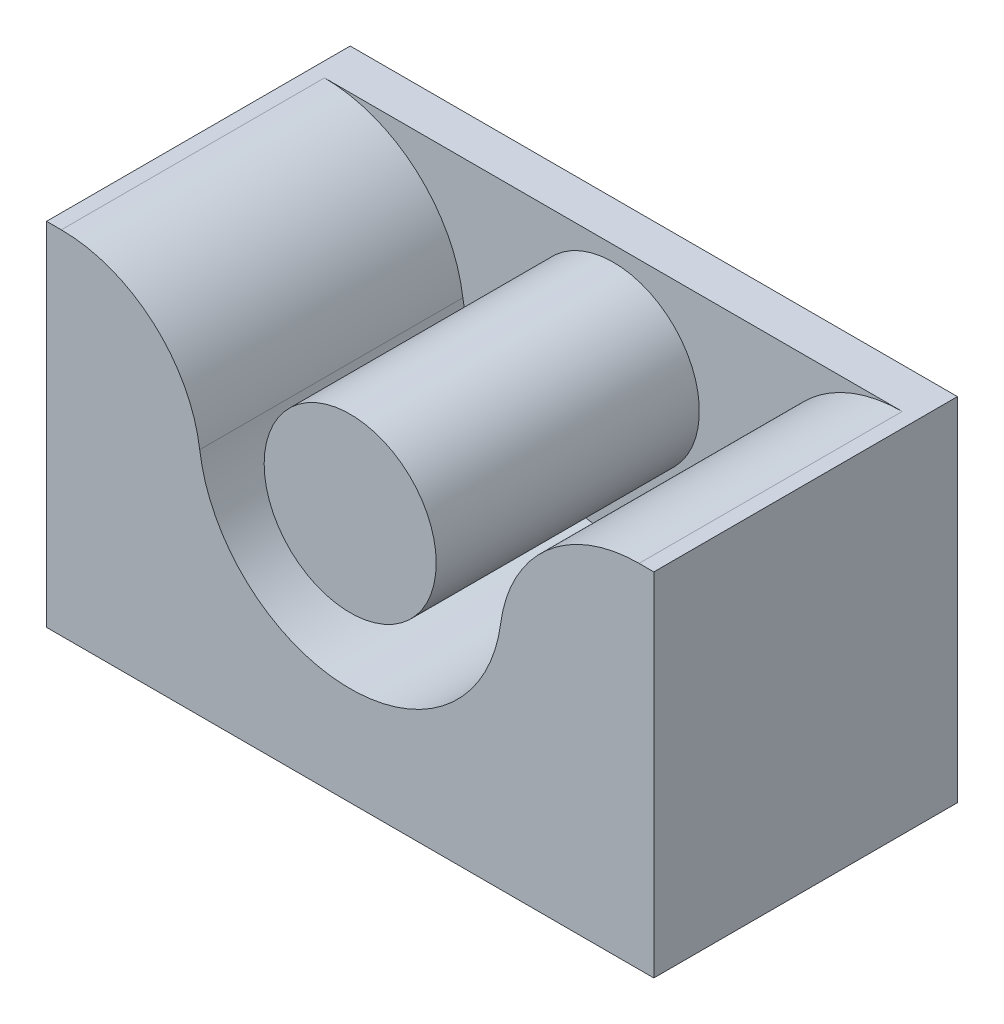
ISO-10303-21;
HEADER;
FILE_DESCRIPTION(('STEP AP214'),'2;1');
FILE_NAME('part.step','',(''),(''),'','','');
FILE_SCHEMA(('AUTOMOTIVE_DESIGN { 1 0 10303 214 1 1 1 1 }'));
ENDSEC;
DATA;
#1=APPLICATION_CONTEXT('core data for automotive mechanical design processes');
#2=APPLICATION_PROTOCOL_DEFINITION('international standard','automotive_design',2000,#1);
#3=PRODUCT_CONTEXT('',#1,'mechanical');
#4=PRODUCT('Part','Part','',(#3));
#5=PRODUCT_RELATED_PRODUCT_CATEGORY('part','',(#4));
#6=PRODUCT_DEFINITION_FORMATION('','',#4);
#7=PRODUCT_DEFINITION_CONTEXT('part definition',#1,'design');
#8=PRODUCT_DEFINITION('design','',#6,#7);
#9=PRODUCT_DEFINITION_SHAPE('','',#8);
#10=(LENGTH_UNIT() NAMED_UNIT(*) SI_UNIT(.MILLI.,.METRE.));
#11=(NAMED_UNIT(*) PLANE_ANGLE_UNIT() SI_UNIT($,.RADIAN.));
#12=(NAMED_UNIT(*) SI_UNIT($,.STERADIAN.) SOLID_ANGLE_UNIT());
#13=UNCERTAINTY_MEASURE_WITH_UNIT(LENGTH_MEASURE(1.E-05),#10,'distance_accuracy_value','');
#14=(GEOMETRIC_REPRESENTATION_CONTEXT(3) GLOBAL_UNCERTAINTY_ASSIGNED_CONTEXT((#13)) GLOBAL_UNIT_ASSIGNED_CONTEXT((#10,
#11,#12)) REPRESENTATION_CONTEXT('',''));
#15=CARTESIAN_POINT('',(0.,0.,0.));
#16=DIRECTION('',(0.,0.,1.));
#17=DIRECTION('',(1.,0.,0.));
#18=AXIS2_PLACEMENT_3D('',#15,#16,#17);
#19=CARTESIAN_POINT('',(14.9999999999999,-12.3750453764835,2.));
#20=DIRECTION('',(-1.,0.,0.));
#21=DIRECTION('',(0.,-1.,0.));
#22=AXIS2_PLACEMENT_3D('',#19,#20,#21);
#23=PLANE('',#22);
#24=DIRECTION('',(0.,1.,0.));
#25=VECTOR('',#24,1.);
#26=CARTESIAN_POINT('',(14.9999999999999,-12.3750453764835,0.));
#27=LINE('',#26,#25);
#28=CARTESIAN_POINT('',(14.9999999999999,-12.3750453764835,0.));
#29=VERTEX_POINT('',#28);
#30=CARTESIAN_POINT('',(15.,5.,0.));
#31=VERTEX_POINT('',#30);
#32=EDGE_CURVE('E154',#29,#31,#27,.T.);
#33=ORIENTED_EDGE('',*,*,#32,.T.);
#34=DIRECTION('',(0.,0.,-1.));
#35=VECTOR('',#34,1.);
#36=CARTESIAN_POINT('',(15.,5.,2.));
#37=LINE('',#36,#35);
#38=CARTESIAN_POINT('',(14.9999999999999,5.,15.));
#39=VERTEX_POINT('',#38);
#40=EDGE_CURVE('E40',#39,#31,#37,.T.);
#41=ORIENTED_EDGE('',*,*,#40,.F.);
#42=DIRECTION('',(0.,1.,0.));
#43=VECTOR('',#42,1.);
#44=CARTESIAN_POINT('',(14.9999999999999,5.,15.));
#45=LINE('',#44,#43);
#46=CARTESIAN_POINT('',(14.9999999999999,-12.3750453764835,15.));
#47=VERTEX_POINT('',#46);
#48=EDGE_CURVE('E115',#47,#39,#45,.T.);
#49=ORIENTED_EDGE('',*,*,#48,.F.);
#50=DIRECTION('',(0.,0.,-1.));
#51=VECTOR('',#50,1.);
#52=CARTESIAN_POINT('',(14.9999999999999,-12.3750453764835,2.));
#53=LINE('',#52,#51);
#54=EDGE_CURVE('E106',#47,#29,#53,.T.);
#55=ORIENTED_EDGE('',*,*,#54,.T.);
#56=EDGE_LOOP('',(#33,#41,#49,#55));
#57=FACE_BOUND('',#56,.T.);
#58=ADVANCED_FACE('F33',(#57),#23,.F.);
#59=CARTESIAN_POINT('',(-15.,5.,2.));
#60=DIRECTION('',(0.,-1.,0.));
#61=DIRECTION('',(0.,0.,-1.));
#62=AXIS2_PLACEMENT_3D('',#59,#60,#61);
#63=PLANE('',#62);
#64=DIRECTION('',(-1.,0.,0.));
#65=VECTOR('',#64,1.);
#66=CARTESIAN_POINT('',(-15.,5.,0.));
#67=LINE('',#66,#65);
#68=CARTESIAN_POINT('',(-15.,5.,0.));
#69=VERTEX_POINT('',#68);
#70=EDGE_CURVE('E159',#31,#69,#67,.T.);
#71=ORIENTED_EDGE('',*,*,#70,.T.);
#72=DIRECTION('',(0.,0.,-1.));
#73=VECTOR('',#72,1.);
#74=CARTESIAN_POINT('',(-15.,5.,2.));
#75=LINE('',#74,#73);
#76=CARTESIAN_POINT('',(-15.0000000000001,5.,15.));
#77=VERTEX_POINT('',#76);
#78=EDGE_CURVE('E105',#77,#69,#75,.T.);
#79=ORIENTED_EDGE('',*,*,#78,.F.);
#80=DIRECTION('',(-1.,0.,0.));
#81=VECTOR('',#80,1.);
#82=CARTESIAN_POINT('',(-15.0000000000001,5.,15.));
#83=LINE('',#82,#81);
#84=CARTESIAN_POINT('',(-14.2712935337709,5.,15.));
#85=VERTEX_POINT('',#84);
#86=EDGE_CURVE('E120',#85,#77,#83,.T.);
#87=ORIENTED_EDGE('',*,*,#86,.F.);
#88=DIRECTION('',(0.,0.,-1.));
#89=VECTOR('',#88,1.);
#90=CARTESIAN_POINT('',(-14.2712935337709,5.,15.));
#91=LINE('',#90,#89);
#92=CARTESIAN_POINT('',(-14.2712935337709,5.,2.));
#93=VERTEX_POINT('',#92);
#94=EDGE_CURVE('E138',#85,#93,#91,.T.);
#95=ORIENTED_EDGE('',*,*,#94,.T.);
#96=DIRECTION('',(-1.,0.,0.));
#97=VECTOR('',#96,1.);
#98=CARTESIAN_POINT('',(-15.,5.,2.));
#99=LINE('',#98,#97);
#100=CARTESIAN_POINT('',(14.2712935337709,5.,2.));
#101=VERTEX_POINT('',#100);
#102=EDGE_CURVE('E52',#101,#93,#99,.T.);
#103=ORIENTED_EDGE('',*,*,#102,.F.);
#104=DIRECTION('',(0.,0.,-1.));
#105=VECTOR('',#104,1.);
#106=CARTESIAN_POINT('',(14.2712935337709,5.,15.));
#107=LINE('',#106,#105);
#108=CARTESIAN_POINT('',(14.2712935337709,5.,15.));
#109=VERTEX_POINT('',#108);
#110=EDGE_CURVE('E151',#109,#101,#107,.T.);
#111=ORIENTED_EDGE('',*,*,#110,.F.);
#112=DIRECTION('',(-1.,0.,0.));
#113=VECTOR('',#112,1.);
#114=CARTESIAN_POINT('',(14.2712935337709,5.,15.));
#115=LINE('',#114,#113);
#116=EDGE_CURVE('E129',#39,#109,#115,.T.);
#117=ORIENTED_EDGE('',*,*,#116,.F.);
#118=ORIENTED_EDGE('',*,*,#40,.T.);
#119=EDGE_LOOP('',(#71,#79,#87,#95,#103,#111,#117,#118));
#120=FACE_BOUND('',#119,.T.);
#121=ADVANCED_FACE('F167',(#120),#63,.F.);
#122=CARTESIAN_POINT('',(-15.,5.,2.));
#123=DIRECTION('',(1.,0.,0.));
#124=DIRECTION('',(0.,1.,0.));
#125=AXIS2_PLACEMENT_3D('',#122,#123,#124);
#126=PLANE('',#125);
#127=DIRECTION('',(0.,-1.,0.));
#128=VECTOR('',#127,1.);
#129=CARTESIAN_POINT('',(-15.,5.,0.));
#130=LINE('',#129,#128);
#131=CARTESIAN_POINT('',(-15.0000000000001,-12.3750453764835,0.));
#132=VERTEX_POINT('',#131);
#133=EDGE_CURVE('E102',#69,#132,#130,.T.);
#134=ORIENTED_EDGE('',*,*,#133,.T.);
#135=DIRECTION('',(0.,0.,-1.));
#136=VECTOR('',#135,1.);
#137=CARTESIAN_POINT('',(-15.0000000000001,-12.3750453764835,2.));
#138=LINE('',#137,#136);
#139=CARTESIAN_POINT('',(-15.0000000000001,-12.3750453764835,15.));
#140=VERTEX_POINT('',#139);
#141=EDGE_CURVE('E95',#140,#132,#138,.T.);
#142=ORIENTED_EDGE('',*,*,#141,.F.);
#143=DIRECTION('',(0.,-1.,0.));
#144=VECTOR('',#143,1.);
#145=CARTESIAN_POINT('',(-15.0000000000001,5.,15.));
#146=LINE('',#145,#144);
#147=EDGE_CURVE('E100',#77,#140,#146,.T.);
#148=ORIENTED_EDGE('',*,*,#147,.F.);
#149=ORIENTED_EDGE('',*,*,#78,.T.);
#150=EDGE_LOOP('',(#134,#142,#148,#149));
#151=FACE_BOUND('',#150,.T.);
#152=ADVANCED_FACE('F97',(#151),#126,.F.);
#153=CARTESIAN_POINT('',(-15.0000000000001,-12.3750453764835,2.));
#154=DIRECTION('',(0.,1.,0.));
#155=DIRECTION('',(0.,0.,1.));
#156=AXIS2_PLACEMENT_3D('',#153,#154,#155);
#157=PLANE('',#156);
#158=CARTESIAN_POINT('',(-7.,-12.3750453764835,7.5));
#159=DIRECTION('',(0.,-1.,0.));
#160=DIRECTION('',(0.,0.,-1.));
#161=AXIS2_PLACEMENT_3D('',#158,#159,#160);
#162=CIRCLE('',#161,5.);
#163=CARTESIAN_POINT('',(-7.,-12.3750453764835,2.5));
#164=VERTEX_POINT('',#163);
#165=EDGE_CURVE('E202',#164,#164,#162,.T.);
#166=ORIENTED_EDGE('',*,*,#165,.F.);
#167=EDGE_LOOP('',(#166));
#168=FACE_BOUND('',#167,.T.);
#169=CARTESIAN_POINT('',(7.,-12.3750453764835,7.5));
#170=DIRECTION('',(0.,-1.,0.));
#171=DIRECTION('',(0.,0.,-1.));
#172=AXIS2_PLACEMENT_3D('',#169,#170,#171);
#173=CIRCLE('',#172,5.);
#174=CARTESIAN_POINT('',(7.,-12.3750453764835,2.5));
#175=VERTEX_POINT('',#174);
#176=EDGE_CURVE('E205',#175,#175,#173,.T.);
#177=ORIENTED_EDGE('',*,*,#176,.F.);
#178=EDGE_LOOP('',(#177));
#179=FACE_BOUND('',#178,.T.);
#180=DIRECTION('',(1.,0.,0.));
#181=VECTOR('',#180,1.);
#182=CARTESIAN_POINT('',(-15.0000000000001,-12.3750453764835,0.));
#183=LINE('',#182,#181);
#184=EDGE_CURVE('E156',#132,#29,#183,.T.);
#185=ORIENTED_EDGE('',*,*,#184,.T.);
#186=ORIENTED_EDGE('',*,*,#54,.F.);
#187=DIRECTION('',(1.,0.,0.));
#188=VECTOR('',#187,1.);
#189=CARTESIAN_POINT('',(-15.0000000000001,-12.3750453764835,15.));
#190=LINE('',#189,#188);
#191=EDGE_CURVE('E109',#140,#47,#190,.T.);
#192=ORIENTED_EDGE('',*,*,#191,.F.);
#193=ORIENTED_EDGE('',*,*,#141,.T.);
#194=EDGE_LOOP('',(#185,#186,#192,#193));
#195=FACE_BOUND('',#194,.T.);
#196=ADVANCED_FACE('F110',(#168,#179,#195),#157,.F.);
#197=CARTESIAN_POINT('',(0.,0.,2.));
#198=DIRECTION('',(0.,0.,-1.));
#199=DIRECTION('',(-1.,0.,0.));
#200=AXIS2_PLACEMENT_3D('',#197,#198,#199);
#201=PLANE('',#200);
#202=CARTESIAN_POINT('',(0.,0.,2.));
#203=DIRECTION('',(0.,0.,-1.));
#204=DIRECTION('',(-1.,0.,0.));
#205=AXIS2_PLACEMENT_3D('',#202,#203,#204);
#206=CIRCLE('',#205,4.25);
#207=CARTESIAN_POINT('',(-4.25,0.,2.));
#208=VERTEX_POINT('',#207);
#209=EDGE_CURVE('E11',#208,#208,#206,.F.);
#210=ORIENTED_EDGE('',*,*,#209,.F.);
#211=EDGE_LOOP('',(#210));
#212=FACE_BOUND('',#211,.T.);
#213=CARTESIAN_POINT('',(-14.2712935337709,-1.89679276508199,2.));
#214=DIRECTION('',(0.,0.,1.));
#215=DIRECTION('',(1.,0.,0.));
#216=AXIS2_PLACEMENT_3D('',#213,#214,#215);
#217=CIRCLE('',#216,6.89679276508199);
#218=CARTESIAN_POINT('',(-7.43462125556767,-0.988132980049458,2.));
#219=VERTEX_POINT('',#218);
#220=EDGE_CURVE('E47',#219,#93,#217,.T.);
#221=ORIENTED_EDGE('',*,*,#220,.F.);
#222=CARTESIAN_POINT('',(0.,0.,2.));
#223=DIRECTION('',(0.,0.,-1.));
#224=DIRECTION('',(1.,0.,0.));
#225=AXIS2_PLACEMENT_3D('',#222,#223,#224);
#226=CIRCLE('',#225,7.5);
#227=CARTESIAN_POINT('',(7.43462125556767,-0.988132980049457,2.));
#228=VERTEX_POINT('',#227);
#229=EDGE_CURVE('E122',#228,#219,#226,.T.);
#230=ORIENTED_EDGE('',*,*,#229,.F.);
#231=CARTESIAN_POINT('',(14.2712935337709,-1.89679276508199,2.));
#232=DIRECTION('',(0.,0.,1.));
#233=DIRECTION('',(-1.,0.,0.));
#234=AXIS2_PLACEMENT_3D('',#231,#232,#233);
#235=CIRCLE('',#234,6.89679276508199);
#236=EDGE_CURVE('E139',#101,#228,#235,.T.);
#237=ORIENTED_EDGE('',*,*,#236,.F.);
#238=ORIENTED_EDGE('',*,*,#102,.T.);
#239=EDGE_LOOP('',(#221,#230,#237,#238));
#240=FACE_BOUND('',#239,.T.);
#241=ADVANCED_FACE('F175',(#212,#240),#201,.F.);
#242=CARTESIAN_POINT('',(0.,0.,0.));
#243=DIRECTION('',(0.,0.,-1.));
#244=DIRECTION('',(-1.,0.,0.));
#245=AXIS2_PLACEMENT_3D('',#242,#243,#244);
#246=PLANE('',#245);
#247=ORIENTED_EDGE('',*,*,#32,.F.);
#248=ORIENTED_EDGE('',*,*,#184,.F.);
#249=ORIENTED_EDGE('',*,*,#133,.F.);
#250=ORIENTED_EDGE('',*,*,#70,.F.);
#251=EDGE_LOOP('',(#247,#248,#249,#250));
#252=FACE_BOUND('',#251,.T.);
#253=ADVANCED_FACE('F172',(#252),#246,.T.);
#254=CARTESIAN_POINT('',(14.2712935337709,-1.89679276508199,15.));
#255=DIRECTION('',(0.,0.,-1.));
#256=DIRECTION('',(-1.,0.,0.));
#257=AXIS2_PLACEMENT_3D('',#254,#255,#256);
#258=CYLINDRICAL_SURFACE('',#257,6.89679276508199);
#259=ORIENTED_EDGE('',*,*,#236,.T.);
#260=DIRECTION('',(0.,0.,-1.));
#261=VECTOR('',#260,1.);
#262=CARTESIAN_POINT('',(7.43462125556767,-0.988132980049457,15.));
#263=LINE('',#262,#261);
#264=CARTESIAN_POINT('',(7.43462125556767,-0.988132980049457,15.));
#265=VERTEX_POINT('',#264);
#266=EDGE_CURVE('E148',#265,#228,#263,.T.);
#267=ORIENTED_EDGE('',*,*,#266,.F.);
#268=CARTESIAN_POINT('',(14.2712935337709,-1.89679276508199,15.));
#269=DIRECTION('',(0.,0.,1.));
#270=DIRECTION('',(-1.,0.,0.));
#271=AXIS2_PLACEMENT_3D('',#268,#269,#270);
#272=CIRCLE('',#271,6.89679276508199);
#273=EDGE_CURVE('E131',#109,#265,#272,.T.);
#274=ORIENTED_EDGE('',*,*,#273,.F.);
#275=ORIENTED_EDGE('',*,*,#110,.T.);
#276=EDGE_LOOP('',(#259,#267,#274,#275));
#277=FACE_BOUND('',#276,.T.);
#278=ADVANCED_FACE('F174',(#277),#258,.T.);
#279=CARTESIAN_POINT('',(0.,0.,15.));
#280=DIRECTION('',(0.,0.,-1.));
#281=DIRECTION('',(-1.,0.,0.));
#282=AXIS2_PLACEMENT_3D('',#279,#280,#281);
#283=CYLINDRICAL_SURFACE('',#282,7.5);
#284=ORIENTED_EDGE('',*,*,#229,.T.);
#285=DIRECTION('',(0.,0.,-1.));
#286=VECTOR('',#285,1.);
#287=CARTESIAN_POINT('',(-7.43462125556767,-0.988132980049458,15.));
#288=LINE('',#287,#286);
#289=CARTESIAN_POINT('',(-7.43462125556767,-0.988132980049458,15.));
#290=VERTEX_POINT('',#289);
#291=EDGE_CURVE('E145',#290,#219,#288,.T.);
#292=ORIENTED_EDGE('',*,*,#291,.F.);
#293=CARTESIAN_POINT('',(0.,0.,15.));
#294=DIRECTION('',(0.,0.,-1.));
#295=DIRECTION('',(1.,0.,0.));
#296=AXIS2_PLACEMENT_3D('',#293,#294,#295);
#297=CIRCLE('',#296,7.5);
#298=EDGE_CURVE('E133',#265,#290,#297,.T.);
#299=ORIENTED_EDGE('',*,*,#298,.F.);
#300=ORIENTED_EDGE('',*,*,#266,.T.);
#301=EDGE_LOOP('',(#284,#292,#299,#300));
#302=FACE_BOUND('',#301,.T.);
#303=ADVANCED_FACE('F181',(#302),#283,.F.);
#304=CARTESIAN_POINT('',(-14.2712935337709,-1.89679276508199,15.));
#305=DIRECTION('',(0.,0.,-1.));
#306=DIRECTION('',(-1.,0.,0.));
#307=AXIS2_PLACEMENT_3D('',#304,#305,#306);
#308=CYLINDRICAL_SURFACE('',#307,6.89679276508199);
#309=ORIENTED_EDGE('',*,*,#220,.T.);
#310=ORIENTED_EDGE('',*,*,#94,.F.);
#311=CARTESIAN_POINT('',(-14.2712935337709,-1.89679276508199,15.));
#312=DIRECTION('',(0.,0.,1.));
#313=DIRECTION('',(1.,0.,0.));
#314=AXIS2_PLACEMENT_3D('',#311,#312,#313);
#315=CIRCLE('',#314,6.89679276508199);
#316=EDGE_CURVE('E135',#290,#85,#315,.T.);
#317=ORIENTED_EDGE('',*,*,#316,.F.);
#318=ORIENTED_EDGE('',*,*,#291,.T.);
#319=EDGE_LOOP('',(#309,#310,#317,#318));
#320=FACE_BOUND('',#319,.T.);
#321=ADVANCED_FACE('F232',(#320),#308,.T.);
#322=CARTESIAN_POINT('',(14.2712935337709,-1.89679276508199,15.));
#323=DIRECTION('',(0.,0.,-1.));
#324=DIRECTION('',(-1.,0.,0.));
#325=AXIS2_PLACEMENT_3D('',#322,#323,#324);
#326=PLANE('',#325);
#327=ORIENTED_EDGE('',*,*,#147,.T.);
#328=ORIENTED_EDGE('',*,*,#191,.T.);
#329=ORIENTED_EDGE('',*,*,#48,.T.);
#330=ORIENTED_EDGE('',*,*,#116,.T.);
#331=ORIENTED_EDGE('',*,*,#273,.T.);
#332=ORIENTED_EDGE('',*,*,#298,.T.);
#333=ORIENTED_EDGE('',*,*,#316,.T.);
#334=ORIENTED_EDGE('',*,*,#86,.T.);
#335=EDGE_LOOP('',(#327,#328,#329,#330,#331,#332,#333,#334));
#336=FACE_BOUND('',#335,.T.);
#337=ADVANCED_FACE('F118',(#336),#326,.F.);
#338=CARTESIAN_POINT('',(0.,0.,15.));
#339=DIRECTION('',(0.,0.,-1.));
#340=DIRECTION('',(-1.,0.,0.));
#341=AXIS2_PLACEMENT_3D('',#338,#339,#340);
#342=CYLINDRICAL_SURFACE('',#341,4.25);
#343=CARTESIAN_POINT('',(0.,0.,15.));
#344=DIRECTION('',(0.,0.,1.));
#345=DIRECTION('',(1.,0.,0.));
#346=AXIS2_PLACEMENT_3D('',#343,#344,#345);
#347=CIRCLE('',#346,4.25);
#348=CARTESIAN_POINT('',(4.25,0.,15.));
#349=VERTEX_POINT('',#348);
#350=EDGE_CURVE('E125',#349,#349,#347,.T.);
#351=ORIENTED_EDGE('',*,*,#350,.F.);
#352=EDGE_LOOP('',(#351));
#353=FACE_BOUND('',#352,.T.);
#354=ORIENTED_EDGE('',*,*,#209,.T.);
#355=EDGE_LOOP('',(#354));
#356=FACE_BOUND('',#355,.T.);
#357=ADVANCED_FACE('F221',(#353,#356),#342,.T.);
#358=CARTESIAN_POINT('',(0.,0.,15.));
#359=DIRECTION('',(0.,0.,1.));
#360=DIRECTION('',(1.,0.,0.));
#361=AXIS2_PLACEMENT_3D('',#358,#359,#360);
#362=PLANE('',#361);
#363=ORIENTED_EDGE('',*,*,#350,.T.);
#364=EDGE_LOOP('',(#363));
#365=FACE_BOUND('',#364,.T.);
#366=ADVANCED_FACE('F219',(#365),#362,.T.);
#367=CARTESIAN_POINT('',(7.,-7.77504537648355,7.5));
#368=DIRECTION('',(0.,-1.,0.));
#369=DIRECTION('',(0.,0.,-1.));
#370=AXIS2_PLACEMENT_3D('',#367,#368,#369);
#371=CYLINDRICAL_SURFACE('',#370,5.);
#372=CARTESIAN_POINT('',(7.,-7.77504537648355,7.5));
#373=DIRECTION('',(0.,-1.,0.));
#374=DIRECTION('',(0.,0.,-1.));
#375=AXIS2_PLACEMENT_3D('',#372,#373,#374);
#376=CIRCLE('',#375,5.);
#377=CARTESIAN_POINT('',(7.,-7.77504537648355,2.5));
#378=VERTEX_POINT('',#377);
#379=EDGE_CURVE('E207',#378,#378,#376,.T.);
#380=ORIENTED_EDGE('',*,*,#379,.F.);
#381=EDGE_LOOP('',(#380));
#382=FACE_BOUND('',#381,.T.);
#383=ORIENTED_EDGE('',*,*,#176,.T.);
#384=EDGE_LOOP('',(#383));
#385=FACE_BOUND('',#384,.T.);
#386=ADVANCED_FACE('F230',(#382,#385),#371,.F.);
#387=CARTESIAN_POINT('',(7.,-7.77504537648355,7.5));
#388=DIRECTION('',(0.,-1.,0.));
#389=DIRECTION('',(0.,0.,-1.));
#390=AXIS2_PLACEMENT_3D('',#387,#388,#389);
#391=PLANE('',#390);
#392=ORIENTED_EDGE('',*,*,#379,.T.);
#393=EDGE_LOOP('',(#392));
#394=FACE_BOUND('',#393,.T.);
#395=ADVANCED_FACE('F285',(#394),#391,.T.);
#396=CARTESIAN_POINT('',(-7.,-7.77504537648355,7.5));
#397=DIRECTION('',(0.,-1.,0.));
#398=DIRECTION('',(0.,0.,-1.));
#399=AXIS2_PLACEMENT_3D('',#396,#397,#398);
#400=CYLINDRICAL_SURFACE('',#399,5.);
#401=CARTESIAN_POINT('',(-7.,-7.77504537648355,7.5));
#402=DIRECTION('',(0.,-1.,0.));
#403=DIRECTION('',(0.,0.,-1.));
#404=AXIS2_PLACEMENT_3D('',#401,#402,#403);
#405=CIRCLE('',#404,5.);
#406=CARTESIAN_POINT('',(-7.,-7.77504537648355,2.5));
#407=VERTEX_POINT('',#406);
#408=EDGE_CURVE('E212',#407,#407,#405,.T.);
#409=ORIENTED_EDGE('',*,*,#408,.F.);
#410=EDGE_LOOP('',(#409));
#411=FACE_BOUND('',#410,.T.);
#412=ORIENTED_EDGE('',*,*,#165,.T.);
#413=EDGE_LOOP('',(#412));
#414=FACE_BOUND('',#413,.T.);
#415=ADVANCED_FACE('F294',(#411,#414),#400,.F.);
#416=CARTESIAN_POINT('',(-7.,-7.77504537648355,7.5));
#417=DIRECTION('',(0.,-1.,0.));
#418=DIRECTION('',(0.,0.,-1.));
#419=AXIS2_PLACEMENT_3D('',#416,#417,#418);
#420=PLANE('',#419);
#421=ORIENTED_EDGE('',*,*,#408,.T.);
#422=EDGE_LOOP('',(#421));
#423=FACE_BOUND('',#422,.T.);
#424=ADVANCED_FACE('F304',(#423),#420,.T.);
#425=CLOSED_SHELL('',(#58,#121,#152,#196,#241,#253,#278,#303,#321,#337,#357,#366,#386,#395,#415,#424));
#426=MANIFOLD_SOLID_BREP('B2',#425);
#427=ADVANCED_BREP_SHAPE_REPRESENTATION('',(#18,#426),#14);
#428=SHAPE_DEFINITION_REPRESENTATION(#9,#427);
ENDSEC;
END-ISO-10303-21;
